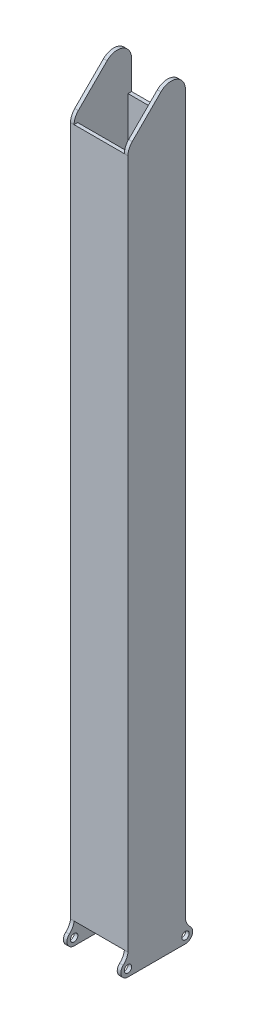
ISO-10303-21;
HEADER;
FILE_DESCRIPTION(('STEP AP214'),'2;1');
FILE_NAME('part.step','',(''),(''),'','','');
FILE_SCHEMA(('AUTOMOTIVE_DESIGN { 1 0 10303 214 1 1 1 1 }'));
ENDSEC;
DATA;
#1=APPLICATION_CONTEXT('core data for automotive mechanical design processes');
#2=APPLICATION_PROTOCOL_DEFINITION('international standard','automotive_design',2000,#1);
#3=PRODUCT_CONTEXT('',#1,'mechanical');
#4=PRODUCT('Part','Part','',(#3));
#5=PRODUCT_RELATED_PRODUCT_CATEGORY('part','',(#4));
#6=PRODUCT_DEFINITION_FORMATION('','',#4);
#7=PRODUCT_DEFINITION_CONTEXT('part definition',#1,'design');
#8=PRODUCT_DEFINITION('design','',#6,#7);
#9=PRODUCT_DEFINITION_SHAPE('','',#8);
#10=(LENGTH_UNIT() NAMED_UNIT(*) SI_UNIT(.MILLI.,.METRE.));
#11=(NAMED_UNIT(*) PLANE_ANGLE_UNIT() SI_UNIT($,.RADIAN.));
#12=(NAMED_UNIT(*) SI_UNIT($,.STERADIAN.) SOLID_ANGLE_UNIT());
#13=UNCERTAINTY_MEASURE_WITH_UNIT(LENGTH_MEASURE(1.E-05),#10,'distance_accuracy_value','');
#14=(GEOMETRIC_REPRESENTATION_CONTEXT(3) GLOBAL_UNCERTAINTY_ASSIGNED_CONTEXT((#13)) GLOBAL_UNIT_ASSIGNED_CONTEXT((#10,
#11,#12)) REPRESENTATION_CONTEXT('',''));
#15=CARTESIAN_POINT('',(0.,0.,0.));
#16=DIRECTION('',(0.,0.,1.));
#17=DIRECTION('',(1.,0.,0.));
#18=AXIS2_PLACEMENT_3D('',#15,#16,#17);
#19=CARTESIAN_POINT('',(0.,152.4,0.));
#20=DIRECTION('',(0.,-1.,0.));
#21=DIRECTION('',(0.,0.,-1.));
#22=AXIS2_PLACEMENT_3D('',#19,#20,#21);
#23=PLANE('',#22);
#24=DIRECTION('',(1.,0.,0.));
#25=VECTOR('',#24,1.);
#26=CARTESIAN_POINT('',(-12.7,152.4,12.7));
#27=LINE('',#26,#25);
#28=CARTESIAN_POINT('',(-11.1125,152.4,12.7));
#29=VERTEX_POINT('',#28);
#30=CARTESIAN_POINT('',(11.1125,152.4,12.7));
#31=VERTEX_POINT('',#30);
#32=EDGE_CURVE('E506',#29,#31,#27,.T.);
#33=ORIENTED_EDGE('',*,*,#32,.T.);
#34=DIRECTION('',(0.,0.,-1.));
#35=VECTOR('',#34,1.);
#36=CARTESIAN_POINT('',(11.1125,152.4,12.7));
#37=LINE('',#36,#35);
#38=CARTESIAN_POINT('',(11.1125,152.4,11.1125));
#39=VERTEX_POINT('',#38);
#40=EDGE_CURVE('E248',#31,#39,#37,.T.);
#41=ORIENTED_EDGE('',*,*,#40,.T.);
#42=DIRECTION('',(1.,0.,0.));
#43=VECTOR('',#42,1.);
#44=CARTESIAN_POINT('',(0.,152.4,11.1125));
#45=LINE('',#44,#43);
#46=CARTESIAN_POINT('',(-11.1125,152.4,11.1125));
#47=VERTEX_POINT('',#46);
#48=EDGE_CURVE('E478',#47,#39,#45,.T.);
#49=ORIENTED_EDGE('',*,*,#48,.F.);
#50=DIRECTION('',(0.,0.,-1.));
#51=VECTOR('',#50,1.);
#52=CARTESIAN_POINT('',(-11.1125,152.4,0.));
#53=LINE('',#52,#51);
#54=EDGE_CURVE('E79',#29,#47,#53,.T.);
#55=ORIENTED_EDGE('',*,*,#54,.F.);
#56=EDGE_LOOP('',(#33,#41,#49,#55));
#57=FACE_BOUND('',#56,.T.);
#58=ADVANCED_FACE('F67',(#57),#23,.F.);
#59=DIRECTION('',(1.,0.,0.));
#60=VECTOR('',#59,1.);
#61=CARTESIAN_POINT('',(0.,152.4,-11.1125));
#62=LINE('',#61,#60);
#63=CARTESIAN_POINT('',(-11.1125,152.4,-11.1125));
#64=VERTEX_POINT('',#63);
#65=CARTESIAN_POINT('',(11.1125,152.4,-11.1125));
#66=VERTEX_POINT('',#65);
#67=EDGE_CURVE('E474',#64,#66,#62,.T.);
#68=ORIENTED_EDGE('',*,*,#67,.T.);
#69=CARTESIAN_POINT('',(11.1125,152.4,-12.7));
#70=VERTEX_POINT('',#69);
#71=EDGE_CURVE('E277',#66,#70,#37,.T.);
#72=ORIENTED_EDGE('',*,*,#71,.T.);
#73=DIRECTION('',(1.,0.,0.));
#74=VECTOR('',#73,1.);
#75=CARTESIAN_POINT('',(-12.7,152.4,-12.7));
#76=LINE('',#75,#74);
#77=CARTESIAN_POINT('',(-11.1125,152.4,-12.7));
#78=VERTEX_POINT('',#77);
#79=EDGE_CURVE('E502',#78,#70,#76,.T.);
#80=ORIENTED_EDGE('',*,*,#79,.F.);
#81=EDGE_CURVE('E12',#64,#78,#53,.T.);
#82=ORIENTED_EDGE('',*,*,#81,.F.);
#83=EDGE_LOOP('',(#68,#72,#80,#82));
#84=FACE_BOUND('',#83,.T.);
#85=ADVANCED_FACE('F561',(#84),#23,.F.);
#86=CARTESIAN_POINT('',(0.,-152.4,0.));
#87=DIRECTION('',(0.,-1.,0.));
#88=DIRECTION('',(0.,0.,-1.));
#89=AXIS2_PLACEMENT_3D('',#86,#87,#88);
#90=PLANE('',#89);
#91=DIRECTION('',(0.,0.,-1.));
#92=VECTOR('',#91,1.);
#93=CARTESIAN_POINT('',(11.1125,-152.4,12.7));
#94=LINE('',#93,#92);
#95=CARTESIAN_POINT('',(11.1125,-152.4,12.7));
#96=VERTEX_POINT('',#95);
#97=CARTESIAN_POINT('',(11.1125,-152.4,11.1125));
#98=VERTEX_POINT('',#97);
#99=EDGE_CURVE('E93',#96,#98,#94,.T.);
#100=ORIENTED_EDGE('',*,*,#99,.F.);
#101=DIRECTION('',(1.,0.,0.));
#102=VECTOR('',#101,1.);
#103=CARTESIAN_POINT('',(-12.7,-152.4,12.7));
#104=LINE('',#103,#102);
#105=CARTESIAN_POINT('',(-11.1125,-152.4,12.7));
#106=VERTEX_POINT('',#105);
#107=EDGE_CURVE('E517',#106,#96,#104,.T.);
#108=ORIENTED_EDGE('',*,*,#107,.F.);
#109=DIRECTION('',(0.,0.,-1.));
#110=VECTOR('',#109,1.);
#111=CARTESIAN_POINT('',(-11.1125,-152.4,0.));
#112=LINE('',#111,#110);
#113=CARTESIAN_POINT('',(-11.1125,-152.4,11.1125));
#114=VERTEX_POINT('',#113);
#115=EDGE_CURVE('E448',#106,#114,#112,.T.);
#116=ORIENTED_EDGE('',*,*,#115,.T.);
#117=DIRECTION('',(1.,0.,0.));
#118=VECTOR('',#117,1.);
#119=CARTESIAN_POINT('',(0.,-152.4,11.1125));
#120=LINE('',#119,#118);
#121=EDGE_CURVE('E479',#114,#98,#120,.T.);
#122=ORIENTED_EDGE('',*,*,#121,.T.);
#123=EDGE_LOOP('',(#100,#108,#116,#122));
#124=FACE_BOUND('',#123,.T.);
#125=ADVANCED_FACE('F612',(#124),#90,.T.);
#126=CARTESIAN_POINT('',(11.1125,-152.4,-11.1125));
#127=VERTEX_POINT('',#126);
#128=CARTESIAN_POINT('',(11.1125,-152.4,-12.7));
#129=VERTEX_POINT('',#128);
#130=EDGE_CURVE('E367',#127,#129,#94,.T.);
#131=ORIENTED_EDGE('',*,*,#130,.F.);
#132=DIRECTION('',(1.,0.,0.));
#133=VECTOR('',#132,1.);
#134=CARTESIAN_POINT('',(0.,-152.4,-11.1125));
#135=LINE('',#134,#133);
#136=CARTESIAN_POINT('',(-11.1125,-152.4,-11.1125));
#137=VERTEX_POINT('',#136);
#138=EDGE_CURVE('E464',#137,#127,#135,.T.);
#139=ORIENTED_EDGE('',*,*,#138,.F.);
#140=CARTESIAN_POINT('',(-11.1125,-152.4,-12.7));
#141=VERTEX_POINT('',#140);
#142=EDGE_CURVE('E77',#137,#141,#112,.T.);
#143=ORIENTED_EDGE('',*,*,#142,.T.);
#144=DIRECTION('',(1.,0.,0.));
#145=VECTOR('',#144,1.);
#146=CARTESIAN_POINT('',(-12.7,-152.4,-12.7));
#147=LINE('',#146,#145);
#148=EDGE_CURVE('E492',#141,#129,#147,.T.);
#149=ORIENTED_EDGE('',*,*,#148,.T.);
#150=EDGE_LOOP('',(#131,#139,#143,#149));
#151=FACE_BOUND('',#150,.T.);
#152=ADVANCED_FACE('F549',(#151),#90,.T.);
#153=CARTESIAN_POINT('',(-12.7,152.4,12.7));
#154=DIRECTION('',(-1.,0.,0.));
#155=DIRECTION('',(0.,0.,1.));
#156=AXIS2_PLACEMENT_3D('',#153,#154,#155);
#157=PLANE('',#156);
#158=CARTESIAN_POINT('',(-12.7,-158.75,-12.7));
#159=DIRECTION('',(-1.,0.,0.));
#160=DIRECTION('',(0.,0.,1.));
#161=AXIS2_PLACEMENT_3D('',#158,#159,#160);
#162=CIRCLE('',#161,1.63194999999999);
#163=CARTESIAN_POINT('',(-12.7,-158.75,-11.06805));
#164=VERTEX_POINT('',#163);
#165=EDGE_CURVE('E328',#164,#164,#162,.T.);
#166=ORIENTED_EDGE('',*,*,#165,.F.);
#167=EDGE_LOOP('',(#166));
#168=FACE_BOUND('',#167,.T.);
#169=CARTESIAN_POINT('',(-12.7,-158.75,12.7));
#170=DIRECTION('',(-1.,0.,0.));
#171=DIRECTION('',(0.,0.,1.));
#172=AXIS2_PLACEMENT_3D('',#169,#170,#171);
#173=CIRCLE('',#172,1.63194999999999);
#174=CARTESIAN_POINT('',(-12.7,-158.75,14.33195));
#175=VERTEX_POINT('',#174);
#176=EDGE_CURVE('E350',#175,#175,#173,.T.);
#177=ORIENTED_EDGE('',*,*,#176,.F.);
#178=EDGE_LOOP('',(#177));
#179=FACE_BOUND('',#178,.T.);
#180=DIRECTION('',(0.,-1.,0.));
#181=VECTOR('',#180,1.);
#182=CARTESIAN_POINT('',(-12.7,152.4,-12.7));
#183=LINE('',#182,#181);
#184=CARTESIAN_POINT('',(-12.7,165.1,-12.7));
#185=VERTEX_POINT('',#184);
#186=CARTESIAN_POINT('',(-12.7,-152.4,-12.7));
#187=VERTEX_POINT('',#186);
#188=EDGE_CURVE('E512',#185,#187,#183,.T.);
#189=ORIENTED_EDGE('',*,*,#188,.T.);
#190=CARTESIAN_POINT('',(-12.7,-151.60625,-19.0001953094726));
#191=DIRECTION('',(1.,0.,0.));
#192=DIRECTION('',(0.,0.,-1.));
#193=AXIS2_PLACEMENT_3D('',#190,#191,#192);
#194=CIRCLE('',#193,6.34999999999999);
#195=CARTESIAN_POINT('',(-12.7,-156.36875,-14.8000651031575));
#196=VERTEX_POINT('',#195);
#197=EDGE_CURVE('E426',#187,#196,#194,.T.);
#198=ORIENTED_EDGE('',*,*,#197,.T.);
#199=CARTESIAN_POINT('',(-12.7,-158.75,-12.7));
#200=DIRECTION('',(1.,0.,0.));
#201=DIRECTION('',(0.,0.,-1.));
#202=AXIS2_PLACEMENT_3D('',#199,#200,#201);
#203=CIRCLE('',#202,3.175);
#204=CARTESIAN_POINT('',(-12.7,-161.925,-12.7));
#205=VERTEX_POINT('',#204);
#206=EDGE_CURVE('E422',#205,#196,#203,.T.);
#207=ORIENTED_EDGE('',*,*,#206,.F.);
#208=DIRECTION('',(0.,0.,1.));
#209=VECTOR('',#208,1.);
#210=CARTESIAN_POINT('',(-12.7,-161.925,0.));
#211=LINE('',#210,#209);
#212=CARTESIAN_POINT('',(-12.7,-161.925,12.7));
#213=VERTEX_POINT('',#212);
#214=EDGE_CURVE('E437',#205,#213,#211,.T.);
#215=ORIENTED_EDGE('',*,*,#214,.T.);
#216=CARTESIAN_POINT('',(-12.7,-158.75,12.7));
#217=DIRECTION('',(1.,0.,0.));
#218=DIRECTION('',(0.,0.,-1.));
#219=AXIS2_PLACEMENT_3D('',#216,#217,#218);
#220=CIRCLE('',#219,3.175);
#221=CARTESIAN_POINT('',(-12.7,-156.36875,14.8000651031575));
#222=VERTEX_POINT('',#221);
#223=EDGE_CURVE('E434',#213,#222,#220,.F.);
#224=ORIENTED_EDGE('',*,*,#223,.T.);
#225=CARTESIAN_POINT('',(-12.7,-151.60625,19.0001953094726));
#226=DIRECTION('',(1.,0.,0.));
#227=DIRECTION('',(0.,0.,-1.));
#228=AXIS2_PLACEMENT_3D('',#225,#226,#227);
#229=CIRCLE('',#228,6.34999999999999);
#230=CARTESIAN_POINT('',(-12.7,-152.4,12.7));
#231=VERTEX_POINT('',#230);
#232=EDGE_CURVE('E430',#231,#222,#229,.F.);
#233=ORIENTED_EDGE('',*,*,#232,.F.);
#234=DIRECTION('',(0.,-1.,0.));
#235=VECTOR('',#234,1.);
#236=CARTESIAN_POINT('',(-12.7,152.4,12.7));
#237=LINE('',#236,#235);
#238=CARTESIAN_POINT('',(-12.7,152.4,12.7));
#239=VERTEX_POINT('',#238);
#240=EDGE_CURVE('E521',#239,#231,#237,.T.);
#241=ORIENTED_EDGE('',*,*,#240,.F.);
#242=CARTESIAN_POINT('',(-12.7,152.4,6.35));
#243=DIRECTION('',(-1.,0.,0.));
#244=DIRECTION('',(0.,0.,1.));
#245=AXIS2_PLACEMENT_3D('',#242,#243,#244);
#246=CIRCLE('',#245,6.35);
#247=CARTESIAN_POINT('',(-12.7,156.890128060535,10.8401280605346));
#248=VERTEX_POINT('',#247);
#249=EDGE_CURVE('E301',#239,#248,#246,.T.);
#250=ORIENTED_EDGE('',*,*,#249,.T.);
#251=DIRECTION('',(0.,-0.707106781186547,0.707106781186548));
#252=VECTOR('',#251,1.);
#253=CARTESIAN_POINT('',(-12.7,83.8651280605346,83.8651280605346));
#254=LINE('',#253,#252);
#255=CARTESIAN_POINT('',(-12.7,169.590128060535,-1.85987193946543));
#256=VERTEX_POINT('',#255);
#257=EDGE_CURVE('E263',#256,#248,#254,.T.);
#258=ORIENTED_EDGE('',*,*,#257,.F.);
#259=CARTESIAN_POINT('',(-12.7,165.1,-6.35));
#260=DIRECTION('',(-1.,0.,0.));
#261=DIRECTION('',(0.,0.,1.));
#262=AXIS2_PLACEMENT_3D('',#259,#260,#261);
#263=CIRCLE('',#262,6.34999999999999);
#264=EDGE_CURVE('E318',#256,#185,#263,.T.);
#265=ORIENTED_EDGE('',*,*,#264,.T.);
#266=EDGE_LOOP('',(#189,#198,#207,#215,#224,#233,#241,#250,#258,#265));
#267=FACE_BOUND('',#266,.T.);
#268=ADVANCED_FACE('F69',(#168,#179,#267),#157,.T.);
#269=CARTESIAN_POINT('',(-12.7,152.4,12.7));
#270=DIRECTION('',(0.,0.,-1.));
#271=DIRECTION('',(-1.,0.,0.));
#272=AXIS2_PLACEMENT_3D('',#269,#270,#271);
#273=PLANE('',#272);
#274=EDGE_CURVE('E507',#231,#106,#104,.T.);
#275=ORIENTED_EDGE('',*,*,#274,.T.);
#276=ORIENTED_EDGE('',*,*,#107,.T.);
#277=DIRECTION('',(1.,0.,0.));
#278=VECTOR('',#277,1.);
#279=CARTESIAN_POINT('',(11.1125,-152.4,12.7));
#280=LINE('',#279,#278);
#281=CARTESIAN_POINT('',(12.7,-152.4,12.7));
#282=VERTEX_POINT('',#281);
#283=EDGE_CURVE('E416',#96,#282,#280,.T.);
#284=ORIENTED_EDGE('',*,*,#283,.T.);
#285=DIRECTION('',(0.,-1.,0.));
#286=VECTOR('',#285,1.);
#287=CARTESIAN_POINT('',(12.7,152.4,12.7));
#288=LINE('',#287,#286);
#289=CARTESIAN_POINT('',(12.7,152.4,12.7));
#290=VERTEX_POINT('',#289);
#291=EDGE_CURVE('E525',#290,#282,#288,.T.);
#292=ORIENTED_EDGE('',*,*,#291,.F.);
#293=DIRECTION('',(1.,0.,0.));
#294=VECTOR('',#293,1.);
#295=CARTESIAN_POINT('',(11.1125,152.4,12.7));
#296=LINE('',#295,#294);
#297=EDGE_CURVE('E280',#31,#290,#296,.T.);
#298=ORIENTED_EDGE('',*,*,#297,.F.);
#299=ORIENTED_EDGE('',*,*,#32,.F.);
#300=EDGE_CURVE('E508',#239,#29,#27,.T.);
#301=ORIENTED_EDGE('',*,*,#300,.F.);
#302=ORIENTED_EDGE('',*,*,#240,.T.);
#303=EDGE_LOOP('',(#275,#276,#284,#292,#298,#299,#301,#302));
#304=FACE_BOUND('',#303,.T.);
#305=ADVANCED_FACE('F577',(#304),#273,.F.);
#306=CARTESIAN_POINT('',(12.7,152.4,12.7));
#307=DIRECTION('',(-1.,0.,0.));
#308=DIRECTION('',(0.,0.,1.));
#309=AXIS2_PLACEMENT_3D('',#306,#307,#308);
#310=PLANE('',#309);
#311=CARTESIAN_POINT('',(12.7,-158.75,-12.7));
#312=DIRECTION('',(-1.,0.,0.));
#313=DIRECTION('',(0.,0.,1.));
#314=AXIS2_PLACEMENT_3D('',#311,#312,#313);
#315=CIRCLE('',#314,1.63194999999999);
#316=CARTESIAN_POINT('',(12.7,-158.75,-11.06805));
#317=VERTEX_POINT('',#316);
#318=EDGE_CURVE('E338',#317,#317,#315,.T.);
#319=ORIENTED_EDGE('',*,*,#318,.T.);
#320=EDGE_LOOP('',(#319));
#321=FACE_BOUND('',#320,.T.);
#322=CARTESIAN_POINT('',(12.7,-158.75,12.7));
#323=DIRECTION('',(-1.,0.,0.));
#324=DIRECTION('',(0.,0.,1.));
#325=AXIS2_PLACEMENT_3D('',#322,#323,#324);
#326=CIRCLE('',#325,1.63194999999999);
#327=CARTESIAN_POINT('',(12.7,-158.75,14.33195));
#328=VERTEX_POINT('',#327);
#329=EDGE_CURVE('E354',#328,#328,#326,.T.);
#330=ORIENTED_EDGE('',*,*,#329,.T.);
#331=EDGE_LOOP('',(#330));
#332=FACE_BOUND('',#331,.T.);
#333=ORIENTED_EDGE('',*,*,#291,.T.);
#334=CARTESIAN_POINT('',(12.7,-151.60625,19.0001953094726));
#335=DIRECTION('',(-1.,0.,0.));
#336=DIRECTION('',(0.,0.,1.));
#337=AXIS2_PLACEMENT_3D('',#334,#335,#336);
#338=CIRCLE('',#337,6.34999999999999);
#339=CARTESIAN_POINT('',(12.7,-156.36875,14.8000651031575));
#340=VERTEX_POINT('',#339);
#341=EDGE_CURVE('E388',#282,#340,#338,.T.);
#342=ORIENTED_EDGE('',*,*,#341,.T.);
#343=CARTESIAN_POINT('',(12.7,-158.75,12.7));
#344=DIRECTION('',(-1.,0.,0.));
#345=DIRECTION('',(0.,0.,1.));
#346=AXIS2_PLACEMENT_3D('',#343,#344,#345);
#347=CIRCLE('',#346,3.175);
#348=CARTESIAN_POINT('',(12.7,-161.925,12.7));
#349=VERTEX_POINT('',#348);
#350=EDGE_CURVE('E392',#349,#340,#347,.T.);
#351=ORIENTED_EDGE('',*,*,#350,.F.);
#352=DIRECTION('',(0.,0.,1.));
#353=VECTOR('',#352,1.);
#354=CARTESIAN_POINT('',(12.7,-161.925,12.7));
#355=LINE('',#354,#353);
#356=CARTESIAN_POINT('',(12.7,-161.925,-12.7));
#357=VERTEX_POINT('',#356);
#358=EDGE_CURVE('E396',#357,#349,#355,.T.);
#359=ORIENTED_EDGE('',*,*,#358,.F.);
#360=CARTESIAN_POINT('',(12.7,-158.75,-12.7));
#361=DIRECTION('',(-1.,0.,0.));
#362=DIRECTION('',(0.,0.,1.));
#363=AXIS2_PLACEMENT_3D('',#360,#361,#362);
#364=CIRCLE('',#363,3.175);
#365=CARTESIAN_POINT('',(12.7,-156.36875,-14.8000651031575));
#366=VERTEX_POINT('',#365);
#367=EDGE_CURVE('E368',#366,#357,#364,.T.);
#368=ORIENTED_EDGE('',*,*,#367,.F.);
#369=CARTESIAN_POINT('',(12.7,-151.60625,-19.0001953094726));
#370=DIRECTION('',(-1.,0.,0.));
#371=DIRECTION('',(0.,0.,1.));
#372=AXIS2_PLACEMENT_3D('',#369,#370,#371);
#373=CIRCLE('',#372,6.34999999999999);
#374=CARTESIAN_POINT('',(12.7,-152.4,-12.7));
#375=VERTEX_POINT('',#374);
#376=EDGE_CURVE('E362',#366,#375,#373,.T.);
#377=ORIENTED_EDGE('',*,*,#376,.T.);
#378=DIRECTION('',(0.,-1.,0.));
#379=VECTOR('',#378,1.);
#380=CARTESIAN_POINT('',(12.7,152.4,-12.7));
#381=LINE('',#380,#379);
#382=CARTESIAN_POINT('',(12.7,165.1,-12.7));
#383=VERTEX_POINT('',#382);
#384=EDGE_CURVE('E529',#383,#375,#381,.T.);
#385=ORIENTED_EDGE('',*,*,#384,.F.);
#386=CARTESIAN_POINT('',(12.7,165.1,-6.35));
#387=DIRECTION('',(-1.,0.,0.));
#388=DIRECTION('',(0.,0.,1.));
#389=AXIS2_PLACEMENT_3D('',#386,#387,#388);
#390=CIRCLE('',#389,6.34999999999999);
#391=CARTESIAN_POINT('',(12.7,169.590128060535,-1.85987193946544));
#392=VERTEX_POINT('',#391);
#393=EDGE_CURVE('E252',#392,#383,#390,.T.);
#394=ORIENTED_EDGE('',*,*,#393,.F.);
#395=DIRECTION('',(0.,-0.707106781186547,0.707106781186548));
#396=VECTOR('',#395,1.);
#397=CARTESIAN_POINT('',(12.7,153.715128060535,14.0151280605346));
#398=LINE('',#397,#396);
#399=CARTESIAN_POINT('',(12.7,156.890128060535,10.8401280605346));
#400=VERTEX_POINT('',#399);
#401=EDGE_CURVE('E283',#392,#400,#398,.T.);
#402=ORIENTED_EDGE('',*,*,#401,.T.);
#403=CARTESIAN_POINT('',(12.7,152.4,6.35));
#404=DIRECTION('',(-1.,0.,0.));
#405=DIRECTION('',(0.,0.,1.));
#406=AXIS2_PLACEMENT_3D('',#403,#404,#405);
#407=CIRCLE('',#406,6.35);
#408=EDGE_CURVE('E258',#290,#400,#407,.T.);
#409=ORIENTED_EDGE('',*,*,#408,.F.);
#410=EDGE_LOOP('',(#333,#342,#351,#359,#368,#377,#385,#394,#402,#409));
#411=FACE_BOUND('',#410,.T.);
#412=ADVANCED_FACE('F619',(#321,#332,#411),#310,.F.);
#413=CARTESIAN_POINT('',(-12.7,152.4,-12.7));
#414=DIRECTION('',(0.,0.,-1.));
#415=DIRECTION('',(-1.,0.,0.));
#416=AXIS2_PLACEMENT_3D('',#413,#414,#415);
#417=PLANE('',#416);
#418=EDGE_CURVE('E513',#187,#141,#147,.T.);
#419=ORIENTED_EDGE('',*,*,#418,.F.);
#420=ORIENTED_EDGE('',*,*,#188,.F.);
#421=DIRECTION('',(-1.,0.,0.));
#422=VECTOR('',#421,1.);
#423=CARTESIAN_POINT('',(-11.1125,165.1,-12.7));
#424=LINE('',#423,#422);
#425=CARTESIAN_POINT('',(-11.1125,165.1,-12.7));
#426=VERTEX_POINT('',#425);
#427=EDGE_CURVE('E329',#426,#185,#424,.T.);
#428=ORIENTED_EDGE('',*,*,#427,.F.);
#429=DIRECTION('',(0.,-1.,0.));
#430=VECTOR('',#429,1.);
#431=CARTESIAN_POINT('',(-11.1125,0.,-12.7));
#432=LINE('',#431,#430);
#433=EDGE_CURVE('E305',#426,#78,#432,.T.);
#434=ORIENTED_EDGE('',*,*,#433,.T.);
#435=ORIENTED_EDGE('',*,*,#79,.T.);
#436=DIRECTION('',(0.,-1.,0.));
#437=VECTOR('',#436,1.);
#438=CARTESIAN_POINT('',(11.1125,152.4,-12.7));
#439=LINE('',#438,#437);
#440=CARTESIAN_POINT('',(11.1125,165.1,-12.7));
#441=VERTEX_POINT('',#440);
#442=EDGE_CURVE('E272',#441,#70,#439,.T.);
#443=ORIENTED_EDGE('',*,*,#442,.F.);
#444=DIRECTION('',(1.,0.,0.));
#445=VECTOR('',#444,1.);
#446=CARTESIAN_POINT('',(11.1125,165.1,-12.7));
#447=LINE('',#446,#445);
#448=EDGE_CURVE('E291',#441,#383,#447,.T.);
#449=ORIENTED_EDGE('',*,*,#448,.T.);
#450=ORIENTED_EDGE('',*,*,#384,.T.);
#451=DIRECTION('',(1.,0.,0.));
#452=VECTOR('',#451,1.);
#453=CARTESIAN_POINT('',(11.1125,-152.4,-12.7));
#454=LINE('',#453,#452);
#455=EDGE_CURVE('E384',#129,#375,#454,.T.);
#456=ORIENTED_EDGE('',*,*,#455,.F.);
#457=ORIENTED_EDGE('',*,*,#148,.F.);
#458=EDGE_LOOP('',(#419,#420,#428,#434,#435,#443,#449,#450,#456,#457));
#459=FACE_BOUND('',#458,.T.);
#460=ADVANCED_FACE('F541',(#459),#417,.T.);
#461=CARTESIAN_POINT('',(-11.1125,152.4,0.));
#462=DIRECTION('',(-1.,0.,0.));
#463=DIRECTION('',(0.,0.,1.));
#464=AXIS2_PLACEMENT_3D('',#461,#462,#463);
#465=PLANE('',#464);
#466=CARTESIAN_POINT('',(-11.1125,-158.75,-12.7));
#467=DIRECTION('',(-1.,0.,0.));
#468=DIRECTION('',(0.,0.,1.));
#469=AXIS2_PLACEMENT_3D('',#466,#467,#468);
#470=CIRCLE('',#469,1.63194999999999);
#471=CARTESIAN_POINT('',(-11.1125,-158.75,-11.06805));
#472=VERTEX_POINT('',#471);
#473=EDGE_CURVE('E346',#472,#472,#470,.T.);
#474=ORIENTED_EDGE('',*,*,#473,.T.);
#475=EDGE_LOOP('',(#474));
#476=FACE_BOUND('',#475,.T.);
#477=CARTESIAN_POINT('',(-11.1125,-158.75,12.7));
#478=DIRECTION('',(-1.,0.,0.));
#479=DIRECTION('',(0.,0.,1.));
#480=AXIS2_PLACEMENT_3D('',#477,#478,#479);
#481=CIRCLE('',#480,1.63194999999999);
#482=CARTESIAN_POINT('',(-11.1125,-158.75,14.33195));
#483=VERTEX_POINT('',#482);
#484=EDGE_CURVE('E358',#483,#483,#481,.T.);
#485=ORIENTED_EDGE('',*,*,#484,.T.);
#486=EDGE_LOOP('',(#485));
#487=FACE_BOUND('',#486,.T.);
#488=DIRECTION('',(0.,-1.,0.));
#489=VECTOR('',#488,1.);
#490=CARTESIAN_POINT('',(-11.1125,152.4,11.1125));
#491=LINE('',#490,#489);
#492=EDGE_CURVE('E488',#47,#114,#491,.T.);
#493=ORIENTED_EDGE('',*,*,#492,.T.);
#494=ORIENTED_EDGE('',*,*,#115,.F.);
#495=CARTESIAN_POINT('',(-11.1125,-151.60625,19.0001953094726));
#496=DIRECTION('',(1.,0.,0.));
#497=DIRECTION('',(0.,0.,-1.));
#498=AXIS2_PLACEMENT_3D('',#495,#496,#497);
#499=CIRCLE('',#498,6.34999999999999);
#500=CARTESIAN_POINT('',(-11.1125,-156.36875,14.8000651031575));
#501=VERTEX_POINT('',#500);
#502=EDGE_CURVE('E451',#106,#501,#499,.F.);
#503=ORIENTED_EDGE('',*,*,#502,.T.);
#504=CARTESIAN_POINT('',(-11.1125,-158.75,12.7));
#505=DIRECTION('',(1.,0.,0.));
#506=DIRECTION('',(0.,0.,-1.));
#507=AXIS2_PLACEMENT_3D('',#504,#505,#506);
#508=CIRCLE('',#507,3.175);
#509=CARTESIAN_POINT('',(-11.1125,-161.925,12.7));
#510=VERTEX_POINT('',#509);
#511=EDGE_CURVE('E455',#510,#501,#508,.F.);
#512=ORIENTED_EDGE('',*,*,#511,.F.);
#513=DIRECTION('',(0.,0.,1.));
#514=VECTOR('',#513,1.);
#515=CARTESIAN_POINT('',(-11.1125,-161.925,0.));
#516=LINE('',#515,#514);
#517=CARTESIAN_POINT('',(-11.1125,-161.925,-12.7));
#518=VERTEX_POINT('',#517);
#519=EDGE_CURVE('E427',#518,#510,#516,.T.);
#520=ORIENTED_EDGE('',*,*,#519,.F.);
#521=CARTESIAN_POINT('',(-11.1125,-158.75,-12.7));
#522=DIRECTION('',(1.,0.,0.));
#523=DIRECTION('',(0.,0.,-1.));
#524=AXIS2_PLACEMENT_3D('',#521,#522,#523);
#525=CIRCLE('',#524,3.175);
#526=CARTESIAN_POINT('',(-11.1125,-156.36875,-14.8000651031575));
#527=VERTEX_POINT('',#526);
#528=EDGE_CURVE('E404',#518,#527,#525,.T.);
#529=ORIENTED_EDGE('',*,*,#528,.T.);
#530=CARTESIAN_POINT('',(-11.1125,-151.60625,-19.0001953094726));
#531=DIRECTION('',(1.,0.,0.));
#532=DIRECTION('',(0.,0.,-1.));
#533=AXIS2_PLACEMENT_3D('',#530,#531,#532);
#534=CIRCLE('',#533,6.34999999999999);
#535=EDGE_CURVE('E444',#141,#527,#534,.T.);
#536=ORIENTED_EDGE('',*,*,#535,.F.);
#537=ORIENTED_EDGE('',*,*,#142,.F.);
#538=DIRECTION('',(0.,-1.,0.));
#539=VECTOR('',#538,1.);
#540=CARTESIAN_POINT('',(-11.1125,152.4,-11.1125));
#541=LINE('',#540,#539);
#542=EDGE_CURVE('E483',#64,#137,#541,.T.);
#543=ORIENTED_EDGE('',*,*,#542,.F.);
#544=ORIENTED_EDGE('',*,*,#81,.T.);
#545=ORIENTED_EDGE('',*,*,#433,.F.);
#546=CARTESIAN_POINT('',(-11.1125,165.1,-6.35));
#547=DIRECTION('',(-1.,0.,0.));
#548=DIRECTION('',(0.,0.,1.));
#549=AXIS2_PLACEMENT_3D('',#546,#547,#548);
#550=CIRCLE('',#549,6.34999999999999);
#551=CARTESIAN_POINT('',(-11.1125,169.590128060535,-1.85987193946543));
#552=VERTEX_POINT('',#551);
#553=EDGE_CURVE('E300',#552,#426,#550,.T.);
#554=ORIENTED_EDGE('',*,*,#553,.F.);
#555=DIRECTION('',(0.,-0.707106781186547,0.707106781186548));
#556=VECTOR('',#555,1.);
#557=CARTESIAN_POINT('',(-11.1125,83.8651280605346,83.8651280605346));
#558=LINE('',#557,#556);
#559=CARTESIAN_POINT('',(-11.1125,156.890128060535,10.8401280605346));
#560=VERTEX_POINT('',#559);
#561=EDGE_CURVE('E297',#552,#560,#558,.T.);
#562=ORIENTED_EDGE('',*,*,#561,.T.);
#563=CARTESIAN_POINT('',(-11.1125,152.4,6.35));
#564=DIRECTION('',(-1.,0.,0.));
#565=DIRECTION('',(0.,0.,1.));
#566=AXIS2_PLACEMENT_3D('',#563,#564,#565);
#567=CIRCLE('',#566,6.35);
#568=EDGE_CURVE('E310',#29,#560,#567,.T.);
#569=ORIENTED_EDGE('',*,*,#568,.F.);
#570=ORIENTED_EDGE('',*,*,#54,.T.);
#571=EDGE_LOOP('',(#493,#494,#503,#512,#520,#529,#536,#537,#543,#544,#545,#554,#562,#569,#570));
#572=FACE_BOUND('',#571,.T.);
#573=ADVANCED_FACE('F554',(#476,#487,#572),#465,.F.);
#574=CARTESIAN_POINT('',(0.,152.4,11.1125));
#575=DIRECTION('',(0.,0.,-1.));
#576=DIRECTION('',(-1.,0.,0.));
#577=AXIS2_PLACEMENT_3D('',#574,#575,#576);
#578=PLANE('',#577);
#579=ORIENTED_EDGE('',*,*,#121,.F.);
#580=ORIENTED_EDGE('',*,*,#492,.F.);
#581=ORIENTED_EDGE('',*,*,#48,.T.);
#582=DIRECTION('',(0.,-1.,0.));
#583=VECTOR('',#582,1.);
#584=CARTESIAN_POINT('',(11.1125,152.4,11.1125));
#585=LINE('',#584,#583);
#586=EDGE_CURVE('E493',#39,#98,#585,.T.);
#587=ORIENTED_EDGE('',*,*,#586,.T.);
#588=EDGE_LOOP('',(#579,#580,#581,#587));
#589=FACE_BOUND('',#588,.T.);
#590=ADVANCED_FACE('F592',(#589),#578,.T.);
#591=CARTESIAN_POINT('',(11.1125,152.4,0.));
#592=DIRECTION('',(-1.,0.,0.));
#593=DIRECTION('',(0.,0.,1.));
#594=AXIS2_PLACEMENT_3D('',#591,#592,#593);
#595=PLANE('',#594);
#596=CARTESIAN_POINT('',(11.1125,-158.75,-12.7));
#597=DIRECTION('',(-1.,0.,0.));
#598=DIRECTION('',(0.,0.,1.));
#599=AXIS2_PLACEMENT_3D('',#596,#597,#598);
#600=CIRCLE('',#599,1.63194999999999);
#601=CARTESIAN_POINT('',(11.1125,-158.75,-11.06805));
#602=VERTEX_POINT('',#601);
#603=EDGE_CURVE('E342',#602,#602,#600,.T.);
#604=ORIENTED_EDGE('',*,*,#603,.F.);
#605=EDGE_LOOP('',(#604));
#606=FACE_BOUND('',#605,.T.);
#607=CARTESIAN_POINT('',(11.1125,-158.75,12.7));
#608=DIRECTION('',(-1.,0.,0.));
#609=DIRECTION('',(0.,0.,1.));
#610=AXIS2_PLACEMENT_3D('',#607,#608,#609);
#611=CIRCLE('',#610,1.63194999999999);
#612=CARTESIAN_POINT('',(11.1125,-158.75,14.33195));
#613=VERTEX_POINT('',#612);
#614=EDGE_CURVE('E71',#613,#613,#611,.T.);
#615=ORIENTED_EDGE('',*,*,#614,.F.);
#616=EDGE_LOOP('',(#615));
#617=FACE_BOUND('',#616,.T.);
#618=DIRECTION('',(0.,-1.,0.));
#619=VECTOR('',#618,1.);
#620=CARTESIAN_POINT('',(11.1125,152.4,-11.1125));
#621=LINE('',#620,#619);
#622=EDGE_CURVE('E496',#66,#127,#621,.T.);
#623=ORIENTED_EDGE('',*,*,#622,.T.);
#624=ORIENTED_EDGE('',*,*,#130,.T.);
#625=CARTESIAN_POINT('',(11.1125,-151.60625,-19.0001953094726));
#626=DIRECTION('',(-1.,0.,0.));
#627=DIRECTION('',(0.,0.,1.));
#628=AXIS2_PLACEMENT_3D('',#625,#626,#627);
#629=CIRCLE('',#628,6.34999999999999);
#630=CARTESIAN_POINT('',(11.1125,-156.36875,-14.8000651031575));
#631=VERTEX_POINT('',#630);
#632=EDGE_CURVE('E363',#631,#129,#629,.T.);
#633=ORIENTED_EDGE('',*,*,#632,.F.);
#634=CARTESIAN_POINT('',(11.1125,-158.75,-12.7));
#635=DIRECTION('',(-1.,0.,0.));
#636=DIRECTION('',(0.,0.,1.));
#637=AXIS2_PLACEMENT_3D('',#634,#635,#636);
#638=CIRCLE('',#637,3.175);
#639=CARTESIAN_POINT('',(11.1125,-161.925,-12.7));
#640=VERTEX_POINT('',#639);
#641=EDGE_CURVE('E381',#631,#640,#638,.T.);
#642=ORIENTED_EDGE('',*,*,#641,.T.);
#643=DIRECTION('',(0.,0.,1.));
#644=VECTOR('',#643,1.);
#645=CARTESIAN_POINT('',(11.1125,-161.925,12.7));
#646=LINE('',#645,#644);
#647=CARTESIAN_POINT('',(11.1125,-161.925,12.7));
#648=VERTEX_POINT('',#647);
#649=EDGE_CURVE('E378',#640,#648,#646,.T.);
#650=ORIENTED_EDGE('',*,*,#649,.T.);
#651=CARTESIAN_POINT('',(11.1125,-158.75,12.7));
#652=DIRECTION('',(-1.,0.,0.));
#653=DIRECTION('',(0.,0.,1.));
#654=AXIS2_PLACEMENT_3D('',#651,#652,#653);
#655=CIRCLE('',#654,3.175);
#656=CARTESIAN_POINT('',(11.1125,-156.36875,14.8000651031575));
#657=VERTEX_POINT('',#656);
#658=EDGE_CURVE('E375',#648,#657,#655,.T.);
#659=ORIENTED_EDGE('',*,*,#658,.T.);
#660=CARTESIAN_POINT('',(11.1125,-151.60625,19.0001953094726));
#661=DIRECTION('',(-1.,0.,0.));
#662=DIRECTION('',(0.,0.,1.));
#663=AXIS2_PLACEMENT_3D('',#660,#661,#662);
#664=CIRCLE('',#663,6.34999999999999);
#665=EDGE_CURVE('E371',#96,#657,#664,.T.);
#666=ORIENTED_EDGE('',*,*,#665,.F.);
#667=ORIENTED_EDGE('',*,*,#99,.T.);
#668=ORIENTED_EDGE('',*,*,#586,.F.);
#669=ORIENTED_EDGE('',*,*,#40,.F.);
#670=CARTESIAN_POINT('',(11.1125,152.4,6.35));
#671=DIRECTION('',(-1.,0.,0.));
#672=DIRECTION('',(0.,0.,1.));
#673=AXIS2_PLACEMENT_3D('',#670,#671,#672);
#674=CIRCLE('',#673,6.35);
#675=CARTESIAN_POINT('',(11.1125,156.890128060535,10.8401280605346));
#676=VERTEX_POINT('',#675);
#677=EDGE_CURVE('E241',#31,#676,#674,.T.);
#678=ORIENTED_EDGE('',*,*,#677,.T.);
#679=DIRECTION('',(0.,-0.707106781186547,0.707106781186548));
#680=VECTOR('',#679,1.);
#681=CARTESIAN_POINT('',(11.1125,153.715128060535,14.0151280605346));
#682=LINE('',#681,#680);
#683=CARTESIAN_POINT('',(11.1125,169.590128060535,-1.85987193946544));
#684=VERTEX_POINT('',#683);
#685=EDGE_CURVE('E246',#684,#676,#682,.T.);
#686=ORIENTED_EDGE('',*,*,#685,.F.);
#687=CARTESIAN_POINT('',(11.1125,165.1,-6.35));
#688=DIRECTION('',(-1.,0.,0.));
#689=DIRECTION('',(0.,0.,1.));
#690=AXIS2_PLACEMENT_3D('',#687,#688,#689);
#691=CIRCLE('',#690,6.34999999999999);
#692=EDGE_CURVE('E269',#684,#441,#691,.T.);
#693=ORIENTED_EDGE('',*,*,#692,.T.);
#694=ORIENTED_EDGE('',*,*,#442,.T.);
#695=ORIENTED_EDGE('',*,*,#71,.F.);
#696=EDGE_LOOP('',(#623,#624,#633,#642,#650,#659,#666,#667,#668,#669,#678,#686,#693,#694,#695));
#697=FACE_BOUND('',#696,.T.);
#698=ADVANCED_FACE('F244',(#606,#617,#697),#595,.T.);
#699=CARTESIAN_POINT('',(0.,152.4,-11.1125));
#700=DIRECTION('',(0.,0.,-1.));
#701=DIRECTION('',(-1.,0.,0.));
#702=AXIS2_PLACEMENT_3D('',#699,#700,#701);
#703=PLANE('',#702);
#704=ORIENTED_EDGE('',*,*,#138,.T.);
#705=ORIENTED_EDGE('',*,*,#622,.F.);
#706=ORIENTED_EDGE('',*,*,#67,.F.);
#707=ORIENTED_EDGE('',*,*,#542,.T.);
#708=EDGE_LOOP('',(#704,#705,#706,#707));
#709=FACE_BOUND('',#708,.T.);
#710=ADVANCED_FACE('F557',(#709),#703,.F.);
#711=CARTESIAN_POINT('',(-12.7,-158.75,-12.7));
#712=DIRECTION('',(1.,0.,0.));
#713=DIRECTION('',(0.,0.,-1.));
#714=AXIS2_PLACEMENT_3D('',#711,#712,#713);
#715=CYLINDRICAL_SURFACE('',#714,3.175);
#716=ORIENTED_EDGE('',*,*,#528,.F.);
#717=DIRECTION('',(1.,0.,0.));
#718=VECTOR('',#717,1.);
#719=CARTESIAN_POINT('',(-12.7,-161.925,-12.7));
#720=LINE('',#719,#718);
#721=EDGE_CURVE('E461',#205,#518,#720,.T.);
#722=ORIENTED_EDGE('',*,*,#721,.F.);
#723=ORIENTED_EDGE('',*,*,#206,.T.);
#724=DIRECTION('',(1.,0.,0.));
#725=VECTOR('',#724,1.);
#726=CARTESIAN_POINT('',(-12.7,-156.36875,-14.8000651031575));
#727=LINE('',#726,#725);
#728=EDGE_CURVE('E440',#196,#527,#727,.T.);
#729=ORIENTED_EDGE('',*,*,#728,.T.);
#730=EDGE_LOOP('',(#716,#722,#723,#729));
#731=FACE_BOUND('',#730,.T.);
#732=ADVANCED_FACE('F600',(#731),#715,.T.);
#733=CARTESIAN_POINT('',(-12.7,-161.925,0.));
#734=DIRECTION('',(0.,1.,0.));
#735=DIRECTION('',(0.,0.,1.));
#736=AXIS2_PLACEMENT_3D('',#733,#734,#735);
#737=PLANE('',#736);
#738=ORIENTED_EDGE('',*,*,#519,.T.);
#739=DIRECTION('',(1.,0.,0.));
#740=VECTOR('',#739,1.);
#741=CARTESIAN_POINT('',(-12.7,-161.925,12.7));
#742=LINE('',#741,#740);
#743=EDGE_CURVE('E465',#213,#510,#742,.T.);
#744=ORIENTED_EDGE('',*,*,#743,.F.);
#745=ORIENTED_EDGE('',*,*,#214,.F.);
#746=ORIENTED_EDGE('',*,*,#721,.T.);
#747=EDGE_LOOP('',(#738,#744,#745,#746));
#748=FACE_BOUND('',#747,.T.);
#749=ADVANCED_FACE('F666',(#748),#737,.F.);
#750=CARTESIAN_POINT('',(-12.7,-158.75,12.7));
#751=DIRECTION('',(1.,0.,0.));
#752=DIRECTION('',(0.,0.,-1.));
#753=AXIS2_PLACEMENT_3D('',#750,#751,#752);
#754=CYLINDRICAL_SURFACE('',#753,3.175);
#755=ORIENTED_EDGE('',*,*,#511,.T.);
#756=DIRECTION('',(1.,0.,0.));
#757=VECTOR('',#756,1.);
#758=CARTESIAN_POINT('',(-12.7,-156.36875,14.8000651031575));
#759=LINE('',#758,#757);
#760=EDGE_CURVE('E469',#222,#501,#759,.T.);
#761=ORIENTED_EDGE('',*,*,#760,.F.);
#762=ORIENTED_EDGE('',*,*,#223,.F.);
#763=ORIENTED_EDGE('',*,*,#743,.T.);
#764=EDGE_LOOP('',(#755,#761,#762,#763));
#765=FACE_BOUND('',#764,.T.);
#766=ADVANCED_FACE('F669',(#765),#754,.T.);
#767=CARTESIAN_POINT('',(-12.7,-151.60625,19.0001953094726));
#768=DIRECTION('',(1.,0.,0.));
#769=DIRECTION('',(0.,0.,-1.));
#770=AXIS2_PLACEMENT_3D('',#767,#768,#769);
#771=CYLINDRICAL_SURFACE('',#770,6.34999999999999);
#772=ORIENTED_EDGE('',*,*,#502,.F.);
#773=ORIENTED_EDGE('',*,*,#274,.F.);
#774=ORIENTED_EDGE('',*,*,#232,.T.);
#775=ORIENTED_EDGE('',*,*,#760,.T.);
#776=EDGE_LOOP('',(#772,#773,#774,#775));
#777=FACE_BOUND('',#776,.T.);
#778=ADVANCED_FACE('F673',(#777),#771,.F.);
#779=CARTESIAN_POINT('',(-12.7,-151.60625,-19.0001953094726));
#780=DIRECTION('',(1.,0.,0.));
#781=DIRECTION('',(0.,0.,-1.));
#782=AXIS2_PLACEMENT_3D('',#779,#780,#781);
#783=CYLINDRICAL_SURFACE('',#782,6.34999999999999);
#784=ORIENTED_EDGE('',*,*,#535,.T.);
#785=ORIENTED_EDGE('',*,*,#728,.F.);
#786=ORIENTED_EDGE('',*,*,#197,.F.);
#787=ORIENTED_EDGE('',*,*,#418,.T.);
#788=EDGE_LOOP('',(#784,#785,#786,#787));
#789=FACE_BOUND('',#788,.T.);
#790=ADVANCED_FACE('F545',(#789),#783,.F.);
#791=CARTESIAN_POINT('',(11.1125,-151.60625,-19.0001953094726));
#792=DIRECTION('',(1.,0.,0.));
#793=DIRECTION('',(0.,0.,-1.));
#794=AXIS2_PLACEMENT_3D('',#791,#792,#793);
#795=CYLINDRICAL_SURFACE('',#794,6.34999999999999);
#796=ORIENTED_EDGE('',*,*,#376,.F.);
#797=DIRECTION('',(1.,0.,0.));
#798=VECTOR('',#797,1.);
#799=CARTESIAN_POINT('',(11.1125,-156.36875,-14.8000651031575));
#800=LINE('',#799,#798);
#801=EDGE_CURVE('E401',#631,#366,#800,.T.);
#802=ORIENTED_EDGE('',*,*,#801,.F.);
#803=ORIENTED_EDGE('',*,*,#632,.T.);
#804=ORIENTED_EDGE('',*,*,#455,.T.);
#805=EDGE_LOOP('',(#796,#802,#803,#804));
#806=FACE_BOUND('',#805,.T.);
#807=ADVANCED_FACE('F651',(#806),#795,.F.);
#808=CARTESIAN_POINT('',(11.1125,-158.75,-12.7));
#809=DIRECTION('',(1.,0.,0.));
#810=DIRECTION('',(0.,0.,-1.));
#811=AXIS2_PLACEMENT_3D('',#808,#809,#810);
#812=CYLINDRICAL_SURFACE('',#811,3.175);
#813=ORIENTED_EDGE('',*,*,#367,.T.);
#814=DIRECTION('',(1.,0.,0.));
#815=VECTOR('',#814,1.);
#816=CARTESIAN_POINT('',(11.1125,-161.925,-12.7));
#817=LINE('',#816,#815);
#818=EDGE_CURVE('E405',#640,#357,#817,.T.);
#819=ORIENTED_EDGE('',*,*,#818,.F.);
#820=ORIENTED_EDGE('',*,*,#641,.F.);
#821=ORIENTED_EDGE('',*,*,#801,.T.);
#822=EDGE_LOOP('',(#813,#819,#820,#821));
#823=FACE_BOUND('',#822,.T.);
#824=ADVANCED_FACE('F647',(#823),#812,.T.);
#825=CARTESIAN_POINT('',(11.1125,-161.925,12.7));
#826=DIRECTION('',(0.,1.,0.));
#827=DIRECTION('',(0.,0.,1.));
#828=AXIS2_PLACEMENT_3D('',#825,#826,#827);
#829=PLANE('',#828);
#830=ORIENTED_EDGE('',*,*,#358,.T.);
#831=DIRECTION('',(1.,0.,0.));
#832=VECTOR('',#831,1.);
#833=CARTESIAN_POINT('',(11.1125,-161.925,12.7));
#834=LINE('',#833,#832);
#835=EDGE_CURVE('E409',#648,#349,#834,.T.);
#836=ORIENTED_EDGE('',*,*,#835,.F.);
#837=ORIENTED_EDGE('',*,*,#649,.F.);
#838=ORIENTED_EDGE('',*,*,#818,.T.);
#839=EDGE_LOOP('',(#830,#836,#837,#838));
#840=FACE_BOUND('',#839,.T.);
#841=ADVANCED_FACE('F650',(#840),#829,.F.);
#842=CARTESIAN_POINT('',(11.1125,-158.75,12.7));
#843=DIRECTION('',(1.,0.,0.));
#844=DIRECTION('',(0.,0.,-1.));
#845=AXIS2_PLACEMENT_3D('',#842,#843,#844);
#846=CYLINDRICAL_SURFACE('',#845,3.175);
#847=ORIENTED_EDGE('',*,*,#350,.T.);
#848=DIRECTION('',(1.,0.,0.));
#849=VECTOR('',#848,1.);
#850=CARTESIAN_POINT('',(11.1125,-156.36875,14.8000651031575));
#851=LINE('',#850,#849);
#852=EDGE_CURVE('E413',#657,#340,#851,.T.);
#853=ORIENTED_EDGE('',*,*,#852,.F.);
#854=ORIENTED_EDGE('',*,*,#658,.F.);
#855=ORIENTED_EDGE('',*,*,#835,.T.);
#856=EDGE_LOOP('',(#847,#853,#854,#855));
#857=FACE_BOUND('',#856,.T.);
#858=ADVANCED_FACE('F655',(#857),#846,.T.);
#859=CARTESIAN_POINT('',(11.1125,-151.60625,19.0001953094726));
#860=DIRECTION('',(1.,0.,0.));
#861=DIRECTION('',(0.,0.,-1.));
#862=AXIS2_PLACEMENT_3D('',#859,#860,#861);
#863=CYLINDRICAL_SURFACE('',#862,6.34999999999999);
#864=ORIENTED_EDGE('',*,*,#341,.F.);
#865=ORIENTED_EDGE('',*,*,#283,.F.);
#866=ORIENTED_EDGE('',*,*,#665,.T.);
#867=ORIENTED_EDGE('',*,*,#852,.T.);
#868=EDGE_LOOP('',(#864,#865,#866,#867));
#869=FACE_BOUND('',#868,.T.);
#870=ADVANCED_FACE('F644',(#869),#863,.F.);
#871=CARTESIAN_POINT('',(-12.7,-158.75,12.7));
#872=DIRECTION('',(-1.,0.,0.));
#873=DIRECTION('',(0.,0.,1.));
#874=AXIS2_PLACEMENT_3D('',#871,#872,#873);
#875=CYLINDRICAL_SURFACE('',#874,1.63194999999999);
#876=ORIENTED_EDGE('',*,*,#614,.T.);
#877=EDGE_LOOP('',(#876));
#878=FACE_BOUND('',#877,.T.);
#879=ORIENTED_EDGE('',*,*,#329,.F.);
#880=EDGE_LOOP('',(#879));
#881=FACE_BOUND('',#880,.T.);
#882=ADVANCED_FACE('F588',(#878,#881),#875,.F.);
#883=ORIENTED_EDGE('',*,*,#176,.T.);
#884=EDGE_LOOP('',(#883));
#885=FACE_BOUND('',#884,.T.);
#886=ORIENTED_EDGE('',*,*,#484,.F.);
#887=EDGE_LOOP('',(#886));
#888=FACE_BOUND('',#887,.T.);
#889=ADVANCED_FACE('F632',(#885,#888),#875,.F.);
#890=CARTESIAN_POINT('',(-12.7,-158.75,-12.7));
#891=DIRECTION('',(-1.,0.,0.));
#892=DIRECTION('',(0.,0.,1.));
#893=AXIS2_PLACEMENT_3D('',#890,#891,#892);
#894=CYLINDRICAL_SURFACE('',#893,1.63194999999999);
#895=ORIENTED_EDGE('',*,*,#165,.T.);
#896=EDGE_LOOP('',(#895));
#897=FACE_BOUND('',#896,.T.);
#898=ORIENTED_EDGE('',*,*,#473,.F.);
#899=EDGE_LOOP('',(#898));
#900=FACE_BOUND('',#899,.T.);
#901=ADVANCED_FACE('F634',(#897,#900),#894,.F.);
#902=ORIENTED_EDGE('',*,*,#603,.T.);
#903=EDGE_LOOP('',(#902));
#904=FACE_BOUND('',#903,.T.);
#905=ORIENTED_EDGE('',*,*,#318,.F.);
#906=EDGE_LOOP('',(#905));
#907=FACE_BOUND('',#906,.T.);
#908=ADVANCED_FACE('F641',(#904,#907),#894,.F.);
#909=CARTESIAN_POINT('',(-11.1125,83.8651280605346,83.8651280605346));
#910=DIRECTION('',(0.,-0.707106781186548,-0.707106781186547));
#911=DIRECTION('',(0.,0.707106781186547,-0.707106781186548));
#912=AXIS2_PLACEMENT_3D('',#909,#910,#911);
#913=PLANE('',#912);
#914=ORIENTED_EDGE('',*,*,#257,.T.);
#915=DIRECTION('',(-1.,0.,0.));
#916=VECTOR('',#915,1.);
#917=CARTESIAN_POINT('',(-11.1125,156.890128060535,10.8401280605346));
#918=LINE('',#917,#916);
#919=EDGE_CURVE('E325',#560,#248,#918,.T.);
#920=ORIENTED_EDGE('',*,*,#919,.F.);
#921=ORIENTED_EDGE('',*,*,#561,.F.);
#922=DIRECTION('',(-1.,0.,0.));
#923=VECTOR('',#922,1.);
#924=CARTESIAN_POINT('',(-11.1125,169.590128060535,-1.85987193946543));
#925=LINE('',#924,#923);
#926=EDGE_CURVE('E314',#552,#256,#925,.T.);
#927=ORIENTED_EDGE('',*,*,#926,.T.);
#928=EDGE_LOOP('',(#914,#920,#921,#927));
#929=FACE_BOUND('',#928,.T.);
#930=ADVANCED_FACE('F571',(#929),#913,.F.);
#931=CARTESIAN_POINT('',(-11.1125,152.4,6.35));
#932=DIRECTION('',(-1.,0.,0.));
#933=DIRECTION('',(0.,0.,1.));
#934=AXIS2_PLACEMENT_3D('',#931,#932,#933);
#935=CYLINDRICAL_SURFACE('',#934,6.35);
#936=ORIENTED_EDGE('',*,*,#249,.F.);
#937=ORIENTED_EDGE('',*,*,#300,.T.);
#938=ORIENTED_EDGE('',*,*,#568,.T.);
#939=ORIENTED_EDGE('',*,*,#919,.T.);
#940=EDGE_LOOP('',(#936,#937,#938,#939));
#941=FACE_BOUND('',#940,.T.);
#942=ADVANCED_FACE('F574',(#941),#935,.T.);
#943=CARTESIAN_POINT('',(-11.1125,165.1,-6.35));
#944=DIRECTION('',(-1.,0.,0.));
#945=DIRECTION('',(0.,0.,1.));
#946=AXIS2_PLACEMENT_3D('',#943,#944,#945);
#947=CYLINDRICAL_SURFACE('',#946,6.34999999999999);
#948=ORIENTED_EDGE('',*,*,#264,.F.);
#949=ORIENTED_EDGE('',*,*,#926,.F.);
#950=ORIENTED_EDGE('',*,*,#553,.T.);
#951=ORIENTED_EDGE('',*,*,#427,.T.);
#952=EDGE_LOOP('',(#948,#949,#950,#951));
#953=FACE_BOUND('',#952,.T.);
#954=ADVANCED_FACE('F566',(#953),#947,.T.);
#955=CARTESIAN_POINT('',(11.1125,152.4,6.35));
#956=DIRECTION('',(1.,0.,0.));
#957=DIRECTION('',(0.,0.,-1.));
#958=AXIS2_PLACEMENT_3D('',#955,#956,#957);
#959=CYLINDRICAL_SURFACE('',#958,6.35);
#960=ORIENTED_EDGE('',*,*,#408,.T.);
#961=DIRECTION('',(1.,0.,0.));
#962=VECTOR('',#961,1.);
#963=CARTESIAN_POINT('',(11.1125,156.890128060535,10.8401280605346));
#964=LINE('',#963,#962);
#965=EDGE_CURVE('E255',#676,#400,#964,.T.);
#966=ORIENTED_EDGE('',*,*,#965,.F.);
#967=ORIENTED_EDGE('',*,*,#677,.F.);
#968=ORIENTED_EDGE('',*,*,#297,.T.);
#969=EDGE_LOOP('',(#960,#966,#967,#968));
#970=FACE_BOUND('',#969,.T.);
#971=ADVANCED_FACE('F256',(#970),#959,.T.);
#972=CARTESIAN_POINT('',(11.1125,153.715128060535,14.0151280605346));
#973=DIRECTION('',(0.,0.707106781186548,0.707106781186547));
#974=DIRECTION('',(0.,-0.707106781186547,0.707106781186548));
#975=AXIS2_PLACEMENT_3D('',#972,#973,#974);
#976=PLANE('',#975);
#977=ORIENTED_EDGE('',*,*,#401,.F.);
#978=DIRECTION('',(1.,0.,0.));
#979=VECTOR('',#978,1.);
#980=CARTESIAN_POINT('',(11.1125,169.590128060535,-1.85987193946544));
#981=LINE('',#980,#979);
#982=EDGE_CURVE('E264',#684,#392,#981,.T.);
#983=ORIENTED_EDGE('',*,*,#982,.F.);
#984=ORIENTED_EDGE('',*,*,#685,.T.);
#985=ORIENTED_EDGE('',*,*,#965,.T.);
#986=EDGE_LOOP('',(#977,#983,#984,#985));
#987=FACE_BOUND('',#986,.T.);
#988=ADVANCED_FACE('F266',(#987),#976,.T.);
#989=CARTESIAN_POINT('',(11.1125,165.1,-6.35));
#990=DIRECTION('',(1.,0.,0.));
#991=DIRECTION('',(0.,0.,-1.));
#992=AXIS2_PLACEMENT_3D('',#989,#990,#991);
#993=CYLINDRICAL_SURFACE('',#992,6.34999999999999);
#994=ORIENTED_EDGE('',*,*,#393,.T.);
#995=ORIENTED_EDGE('',*,*,#448,.F.);
#996=ORIENTED_EDGE('',*,*,#692,.F.);
#997=ORIENTED_EDGE('',*,*,#982,.T.);
#998=EDGE_LOOP('',(#994,#995,#996,#997));
#999=FACE_BOUND('',#998,.T.);
#1000=ADVANCED_FACE('F707',(#999),#993,.T.);
#1001=CLOSED_SHELL('',(#58,#85,#125,#152,#268,#305,#412,#460,#573,#590,#698,#710,#732,#749,#766,
#778,#790,#807,#824,#841,#858,#870,#882,#889,#901,#908,#930,#942,#954,#971,#988,#1000));
#1002=MANIFOLD_SOLID_BREP('B2',#1001);
#1003=ADVANCED_BREP_SHAPE_REPRESENTATION('',(#18,#1002),#14);
#1004=SHAPE_DEFINITION_REPRESENTATION(#9,#1003);
ENDSEC;
END-ISO-10303-21;
